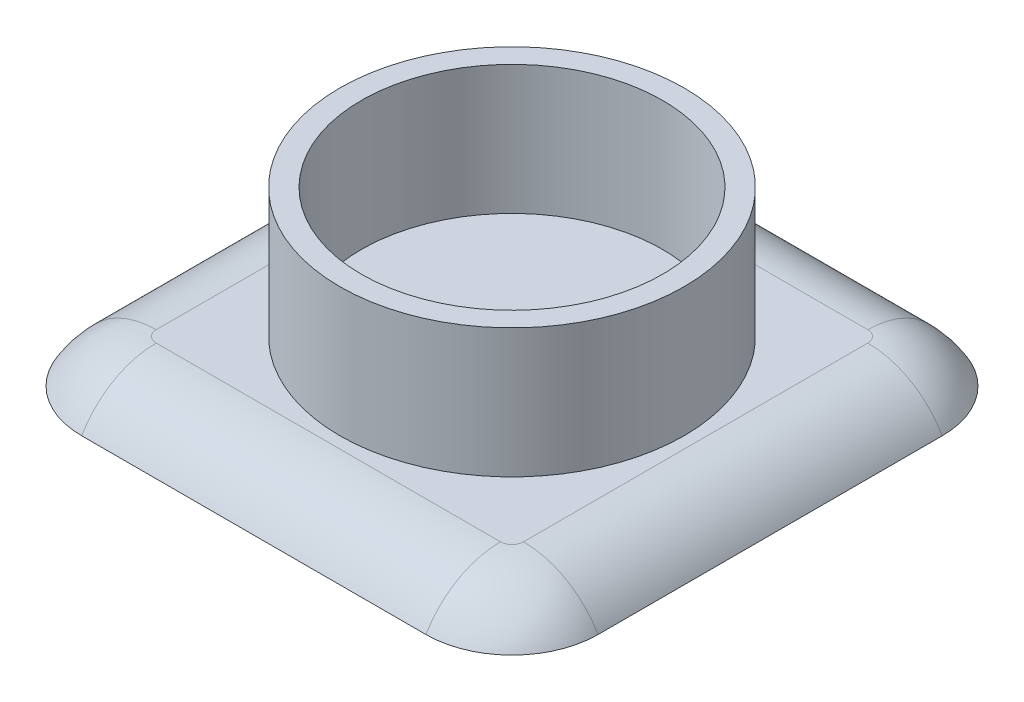
ISO-10303-21;
HEADER;
FILE_DESCRIPTION(('STEP AP214'),'2;1');
FILE_NAME('part.step','',(''),(''),'','','');
FILE_SCHEMA(('AUTOMOTIVE_DESIGN { 1 0 10303 214 1 1 1 1 }'));
ENDSEC;
DATA;
#1=APPLICATION_CONTEXT('core data for automotive mechanical design processes');
#2=APPLICATION_PROTOCOL_DEFINITION('international standard','automotive_design',2000,#1);
#3=PRODUCT_CONTEXT('',#1,'mechanical');
#4=PRODUCT('Part','Part','',(#3));
#5=PRODUCT_RELATED_PRODUCT_CATEGORY('part','',(#4));
#6=PRODUCT_DEFINITION_FORMATION('','',#4);
#7=PRODUCT_DEFINITION_CONTEXT('part definition',#1,'design');
#8=PRODUCT_DEFINITION('design','',#6,#7);
#9=PRODUCT_DEFINITION_SHAPE('','',#8);
#10=(LENGTH_UNIT() NAMED_UNIT(*) SI_UNIT(.MILLI.,.METRE.));
#11=(NAMED_UNIT(*) PLANE_ANGLE_UNIT() SI_UNIT($,.RADIAN.));
#12=(NAMED_UNIT(*) SI_UNIT($,.STERADIAN.) SOLID_ANGLE_UNIT());
#13=UNCERTAINTY_MEASURE_WITH_UNIT(LENGTH_MEASURE(1.E-05),#10,'distance_accuracy_value','');
#14=(GEOMETRIC_REPRESENTATION_CONTEXT(3) GLOBAL_UNCERTAINTY_ASSIGNED_CONTEXT((#13)) GLOBAL_UNIT_ASSIGNED_CONTEXT((#10,
#11,#12)) REPRESENTATION_CONTEXT('',''));
#15=CARTESIAN_POINT('',(0.,0.,0.));
#16=DIRECTION('',(0.,0.,1.));
#17=DIRECTION('',(1.,0.,0.));
#18=AXIS2_PLACEMENT_3D('',#15,#16,#17);
#19=CARTESIAN_POINT('',(0.,3.,0.));
#20=DIRECTION('',(0.,1.,0.));
#21=DIRECTION('',(0.,0.,1.));
#22=AXIS2_PLACEMENT_3D('',#19,#20,#21);
#23=PLANE('',#22);
#24=CARTESIAN_POINT('',(0.,3.,0.));
#25=DIRECTION('',(0.,1.,0.));
#26=DIRECTION('',(0.,0.,1.));
#27=AXIS2_PLACEMENT_3D('',#24,#25,#26);
#28=CIRCLE('',#27,4.);
#29=CARTESIAN_POINT('',(0.,3.,4.00000000000002));
#30=VERTEX_POINT('',#29);
#31=EDGE_CURVE('E163',#30,#30,#28,.T.);
#32=ORIENTED_EDGE('',*,*,#31,.T.);
#33=EDGE_LOOP('',(#32));
#34=FACE_BOUND('',#33,.T.);
#35=CARTESIAN_POINT('',(0.,3.,0.));
#36=DIRECTION('',(0.,1.,0.));
#37=DIRECTION('',(0.,0.,1.));
#38=AXIS2_PLACEMENT_3D('',#35,#36,#37);
#39=CIRCLE('',#38,3.5);
#40=CARTESIAN_POINT('',(0.,3.,3.50000000000001));
#41=VERTEX_POINT('',#40);
#42=EDGE_CURVE('E159',#41,#41,#39,.T.);
#43=ORIENTED_EDGE('',*,*,#42,.F.);
#44=EDGE_LOOP('',(#43));
#45=FACE_BOUND('',#44,.T.);
#46=ADVANCED_FACE('F56',(#34,#45),#23,.T.);
#47=CARTESIAN_POINT('',(0.,3.,0.));
#48=DIRECTION('',(0.,-1.,0.));
#49=DIRECTION('',(0.,0.,-1.));
#50=AXIS2_PLACEMENT_3D('',#47,#48,#49);
#51=CYLINDRICAL_SURFACE('',#50,4.);
#52=ORIENTED_EDGE('',*,*,#31,.F.);
#53=EDGE_LOOP('',(#52));
#54=FACE_BOUND('',#53,.T.);
#55=CARTESIAN_POINT('',(0.,0.,0.));
#56=DIRECTION('',(0.,1.,0.));
#57=DIRECTION('',(0.,0.,1.));
#58=AXIS2_PLACEMENT_3D('',#55,#56,#57);
#59=CIRCLE('',#58,4.);
#60=CARTESIAN_POINT('',(0.,0.,4.00000000000001));
#61=VERTEX_POINT('',#60);
#62=EDGE_CURVE('E158',#61,#61,#59,.T.);
#63=ORIENTED_EDGE('',*,*,#62,.T.);
#64=EDGE_LOOP('',(#63));
#65=FACE_BOUND('',#64,.T.);
#66=ADVANCED_FACE('F254',(#54,#65),#51,.T.);
#67=CARTESIAN_POINT('',(0.,3.,0.));
#68=DIRECTION('',(0.,-1.,0.));
#69=DIRECTION('',(0.,0.,-1.));
#70=AXIS2_PLACEMENT_3D('',#67,#68,#69);
#71=CYLINDRICAL_SURFACE('',#70,3.5);
#72=ORIENTED_EDGE('',*,*,#42,.T.);
#73=EDGE_LOOP('',(#72));
#74=FACE_BOUND('',#73,.T.);
#75=CARTESIAN_POINT('',(0.,0.,0.));
#76=DIRECTION('',(0.,1.,0.));
#77=DIRECTION('',(0.,0.,1.));
#78=AXIS2_PLACEMENT_3D('',#75,#76,#77);
#79=CIRCLE('',#78,3.5);
#80=CARTESIAN_POINT('',(0.,0.,3.50000000000001));
#81=VERTEX_POINT('',#80);
#82=EDGE_CURVE('E164',#81,#81,#79,.T.);
#83=ORIENTED_EDGE('',*,*,#82,.F.);
#84=EDGE_LOOP('',(#83));
#85=FACE_BOUND('',#84,.T.);
#86=ADVANCED_FACE('F260',(#74,#85),#71,.F.);
#87=CARTESIAN_POINT('',(0.,0.,0.));
#88=DIRECTION('',(0.,-1.,0.));
#89=DIRECTION('',(0.,0.,-1.));
#90=AXIS2_PLACEMENT_3D('',#87,#88,#89);
#91=PLANE('',#90);
#92=ORIENTED_EDGE('',*,*,#82,.T.);
#93=EDGE_LOOP('',(#92));
#94=FACE_BOUND('',#93,.T.);
#95=ADVANCED_FACE('F334',(#94),#91,.F.);
#96=CARTESIAN_POINT('',(0.,-0.999999999999999,0.));
#97=DIRECTION('',(0.,-1.,0.));
#98=DIRECTION('',(0.,0.,-1.));
#99=AXIS2_PLACEMENT_3D('',#96,#97,#98);
#100=PLANE('',#99);
#101=DIRECTION('',(0.,0.,1.));
#102=VECTOR('',#101,1.);
#103=CARTESIAN_POINT('',(6.00000000000002,-0.999999999999997,6.));
#104=LINE('',#103,#102);
#105=CARTESIAN_POINT('',(6.,-0.999999999999999,-4.00000000000001));
#106=VERTEX_POINT('',#105);
#107=CARTESIAN_POINT('',(6.,-1.,4.));
#108=VERTEX_POINT('',#107);
#109=EDGE_CURVE('E127',#106,#108,#104,.T.);
#110=ORIENTED_EDGE('',*,*,#109,.T.);
#111=CARTESIAN_POINT('',(4.,-1.,4.));
#112=DIRECTION('',(0.,-1.,0.));
#113=DIRECTION('',(0.,0.,-1.));
#114=AXIS2_PLACEMENT_3D('',#111,#112,#113);
#115=CIRCLE('',#114,2.);
#116=CARTESIAN_POINT('',(4.,-0.99999999999998,6.));
#117=VERTEX_POINT('',#116);
#118=EDGE_CURVE('E119',#108,#117,#115,.T.);
#119=ORIENTED_EDGE('',*,*,#118,.T.);
#120=DIRECTION('',(-1.,0.,0.));
#121=VECTOR('',#120,1.);
#122=CARTESIAN_POINT('',(-6.,-1.,6.));
#123=LINE('',#122,#121);
#124=CARTESIAN_POINT('',(-4.,-1.,6.));
#125=VERTEX_POINT('',#124);
#126=EDGE_CURVE('E124',#117,#125,#123,.T.);
#127=ORIENTED_EDGE('',*,*,#126,.T.);
#128=CARTESIAN_POINT('',(-4.00000000000001,-1.,4.));
#129=DIRECTION('',(0.,-1.,0.));
#130=DIRECTION('',(0.,0.,-1.));
#131=AXIS2_PLACEMENT_3D('',#128,#129,#130);
#132=CIRCLE('',#131,2.);
#133=CARTESIAN_POINT('',(-6.00000000000001,-1.,4.));
#134=VERTEX_POINT('',#133);
#135=EDGE_CURVE('E133',#125,#134,#132,.T.);
#136=ORIENTED_EDGE('',*,*,#135,.T.);
#137=DIRECTION('',(0.,0.,-1.));
#138=VECTOR('',#137,1.);
#139=CARTESIAN_POINT('',(-6.,-1.,6.));
#140=LINE('',#139,#138);
#141=CARTESIAN_POINT('',(-6.00000000000001,-0.999999999999999,-4.00000000000001));
#142=VERTEX_POINT('',#141);
#143=EDGE_CURVE('E147',#134,#142,#140,.T.);
#144=ORIENTED_EDGE('',*,*,#143,.T.);
#145=CARTESIAN_POINT('',(-4.00000000000001,-0.999999999999999,-4.00000000000001));
#146=DIRECTION('',(0.,-1.,0.));
#147=DIRECTION('',(0.,0.,-1.));
#148=AXIS2_PLACEMENT_3D('',#145,#146,#147);
#149=CIRCLE('',#148,2.);
#150=CARTESIAN_POINT('',(-4.00000000000001,-0.999999999999999,-6.00000000000002));
#151=VERTEX_POINT('',#150);
#152=EDGE_CURVE('E177',#142,#151,#149,.T.);
#153=ORIENTED_EDGE('',*,*,#152,.T.);
#154=DIRECTION('',(1.,0.,0.));
#155=VECTOR('',#154,1.);
#156=CARTESIAN_POINT('',(-6.00000000000001,-0.999999999999999,-6.00000000000002));
#157=LINE('',#156,#155);
#158=CARTESIAN_POINT('',(4.,-0.999999999999999,-6.00000000000002));
#159=VERTEX_POINT('',#158);
#160=EDGE_CURVE('E152',#151,#159,#157,.T.);
#161=ORIENTED_EDGE('',*,*,#160,.T.);
#162=CARTESIAN_POINT('',(4.00000000000001,-0.999999999999999,-4.00000000000001));
#163=DIRECTION('',(0.,-1.,0.));
#164=DIRECTION('',(0.,0.,-1.));
#165=AXIS2_PLACEMENT_3D('',#162,#163,#164);
#166=CIRCLE('',#165,2.);
#167=EDGE_CURVE('E171',#159,#106,#166,.T.);
#168=ORIENTED_EDGE('',*,*,#167,.T.);
#169=EDGE_LOOP('',(#110,#119,#127,#136,#144,#153,#161,#168));
#170=FACE_BOUND('',#169,.T.);
#171=ADVANCED_FACE('F121',(#170),#100,.T.);
#172=CARTESIAN_POINT('',(-4.00000000000001,0.,4.));
#173=DIRECTION('',(0.,-1.,0.));
#174=DIRECTION('',(0.,0.,-1.));
#175=AXIS2_PLACEMENT_3D('',#172,#173,#174);
#176=CIRCLE('',#175,0.267949192431123);
#177=CARTESIAN_POINT('',(-4.26794919243113,0.,4.));
#178=VERTEX_POINT('',#177);
#179=CARTESIAN_POINT('',(-4.00000000000001,0.,4.26794919243113));
#180=VERTEX_POINT('',#179);
#181=EDGE_CURVE('E193',#178,#180,#176,.F.);
#182=ORIENTED_EDGE('',*,*,#181,.T.);
#183=DIRECTION('',(-1.,0.,0.));
#184=VECTOR('',#183,1.);
#185=CARTESIAN_POINT('',(0.,0.,4.26794919243112));
#186=LINE('',#185,#184);
#187=CARTESIAN_POINT('',(4.,0.,4.26794919243112));
#188=VERTEX_POINT('',#187);
#189=EDGE_CURVE('E13',#180,#188,#186,.F.);
#190=ORIENTED_EDGE('',*,*,#189,.T.);
#191=CARTESIAN_POINT('',(4.,0.,4.));
#192=DIRECTION('',(0.,-1.,0.));
#193=DIRECTION('',(0.,0.,-1.));
#194=AXIS2_PLACEMENT_3D('',#191,#192,#193);
#195=CIRCLE('',#194,0.267949192431123);
#196=CARTESIAN_POINT('',(4.26794919243112,0.,4.));
#197=VERTEX_POINT('',#196);
#198=EDGE_CURVE('E66',#188,#197,#195,.F.);
#199=ORIENTED_EDGE('',*,*,#198,.T.);
#200=DIRECTION('',(0.,0.,1.));
#201=VECTOR('',#200,1.);
#202=CARTESIAN_POINT('',(4.26794919243112,0.,0.));
#203=LINE('',#202,#201);
#204=CARTESIAN_POINT('',(4.26794919243114,0.,-4.));
#205=VERTEX_POINT('',#204);
#206=EDGE_CURVE('E196',#197,#205,#203,.F.);
#207=ORIENTED_EDGE('',*,*,#206,.T.);
#208=CARTESIAN_POINT('',(4.00000000000002,0.,-4.));
#209=DIRECTION('',(0.,-1.,0.));
#210=DIRECTION('',(0.,0.,-1.));
#211=AXIS2_PLACEMENT_3D('',#208,#209,#210);
#212=CIRCLE('',#211,0.267949192431123);
#213=CARTESIAN_POINT('',(4.,0.,-4.26794919243112));
#214=VERTEX_POINT('',#213);
#215=EDGE_CURVE('E190',#205,#214,#212,.F.);
#216=ORIENTED_EDGE('',*,*,#215,.T.);
#217=DIRECTION('',(1.,0.,0.));
#218=VECTOR('',#217,1.);
#219=CARTESIAN_POINT('',(0.,0.,-4.26794919243114));
#220=LINE('',#219,#218);
#221=CARTESIAN_POINT('',(-4.00000000000001,0.,-4.26794919243113));
#222=VERTEX_POINT('',#221);
#223=EDGE_CURVE('E187',#214,#222,#220,.F.);
#224=ORIENTED_EDGE('',*,*,#223,.T.);
#225=CARTESIAN_POINT('',(-4.00000000000001,0.,-4.00000000000001));
#226=DIRECTION('',(0.,-1.,0.));
#227=DIRECTION('',(0.,0.,-1.));
#228=AXIS2_PLACEMENT_3D('',#225,#226,#227);
#229=CIRCLE('',#228,0.267949192431123);
#230=CARTESIAN_POINT('',(-4.26794919243113,0.,-4.00000000000001));
#231=VERTEX_POINT('',#230);
#232=EDGE_CURVE('E184',#222,#231,#229,.F.);
#233=ORIENTED_EDGE('',*,*,#232,.T.);
#234=DIRECTION('',(0.,0.,-1.));
#235=VECTOR('',#234,1.);
#236=CARTESIAN_POINT('',(-4.26794919243113,0.,0.));
#237=LINE('',#236,#235);
#238=EDGE_CURVE('E132',#231,#178,#237,.F.);
#239=ORIENTED_EDGE('',*,*,#238,.T.);
#240=EDGE_LOOP('',(#182,#190,#199,#207,#216,#224,#233,#239));
#241=FACE_BOUND('',#240,.T.);
#242=ORIENTED_EDGE('',*,*,#62,.F.);
#243=EDGE_LOOP('',(#242));
#244=FACE_BOUND('',#243,.T.);
#245=ADVANCED_FACE('F243',(#241,#244),#91,.F.);
#246=CARTESIAN_POINT('',(4.00000000000001,-2.,-4.00000000000001));
#247=DIRECTION('',(0.,1.,0.));
#248=DIRECTION('',(0.,0.,1.));
#249=AXIS2_PLACEMENT_3D('',#246,#247,#248);
#250=DEGENERATE_TOROIDAL_SURFACE('',#249,0.267949192431123,2.,.T.);
#251=CARTESIAN_POINT('',(4.26794919243103,-2.,-4.));
#252=DIRECTION('',(0.,0.,1.));
#253=DIRECTION('',(1.,0.,0.));
#254=AXIS2_PLACEMENT_3D('',#251,#252,#253);
#255=CIRCLE('',#254,2.);
#256=EDGE_CURVE('E214',#106,#205,#255,.T.);
#257=ORIENTED_EDGE('',*,*,#256,.F.);
#258=ORIENTED_EDGE('',*,*,#167,.F.);
#259=CARTESIAN_POINT('',(4.,-2.,-4.26794919243113));
#260=DIRECTION('',(-1.,0.,0.));
#261=DIRECTION('',(0.,0.,1.));
#262=AXIS2_PLACEMENT_3D('',#259,#260,#261);
#263=CIRCLE('',#262,2.);
#264=EDGE_CURVE('E60',#214,#159,#263,.T.);
#265=ORIENTED_EDGE('',*,*,#264,.F.);
#266=ORIENTED_EDGE('',*,*,#215,.F.);
#267=EDGE_LOOP('',(#257,#258,#265,#266));
#268=FACE_BOUND('',#267,.T.);
#269=ADVANCED_FACE('F58',(#268),#250,.T.);
#270=CARTESIAN_POINT('',(-6.00000000000001,-2.,-4.26794919243114));
#271=DIRECTION('',(1.,0.,0.));
#272=DIRECTION('',(0.,0.,-1.));
#273=AXIS2_PLACEMENT_3D('',#270,#271,#272);
#274=CYLINDRICAL_SURFACE('',#273,2.);
#275=ORIENTED_EDGE('',*,*,#264,.T.);
#276=ORIENTED_EDGE('',*,*,#160,.F.);
#277=CARTESIAN_POINT('',(-4.00000000000001,-2.,-4.26794919243114));
#278=DIRECTION('',(-1.,0.,0.));
#279=DIRECTION('',(0.,0.,1.));
#280=AXIS2_PLACEMENT_3D('',#277,#278,#279);
#281=CIRCLE('',#280,2.);
#282=EDGE_CURVE('E211',#222,#151,#281,.T.);
#283=ORIENTED_EDGE('',*,*,#282,.F.);
#284=ORIENTED_EDGE('',*,*,#223,.F.);
#285=EDGE_LOOP('',(#275,#276,#283,#284));
#286=FACE_BOUND('',#285,.T.);
#287=ADVANCED_FACE('F227',(#286),#274,.T.);
#288=CARTESIAN_POINT('',(4.26794919243113,-2.,6.00000000000002));
#289=DIRECTION('',(0.,0.,1.));
#290=DIRECTION('',(1.,0.,0.));
#291=AXIS2_PLACEMENT_3D('',#288,#289,#290);
#292=CYLINDRICAL_SURFACE('',#291,2.);
#293=ORIENTED_EDGE('',*,*,#256,.T.);
#294=ORIENTED_EDGE('',*,*,#206,.F.);
#295=CARTESIAN_POINT('',(4.26794919243103,-2.,4.));
#296=DIRECTION('',(0.,0.,1.));
#297=DIRECTION('',(1.,0.,0.));
#298=AXIS2_PLACEMENT_3D('',#295,#296,#297);
#299=CIRCLE('',#298,2.);
#300=EDGE_CURVE('E208',#108,#197,#299,.T.);
#301=ORIENTED_EDGE('',*,*,#300,.F.);
#302=ORIENTED_EDGE('',*,*,#109,.F.);
#303=EDGE_LOOP('',(#293,#294,#301,#302));
#304=FACE_BOUND('',#303,.T.);
#305=ADVANCED_FACE('F245',(#304),#292,.T.);
#306=CARTESIAN_POINT('',(-4.00000000000001,-2.,-4.00000000000001));
#307=DIRECTION('',(0.,1.,0.));
#308=DIRECTION('',(0.,0.,1.));
#309=AXIS2_PLACEMENT_3D('',#306,#307,#308);
#310=DEGENERATE_TOROIDAL_SURFACE('',#309,0.267949192431123,2.,.T.);
#311=ORIENTED_EDGE('',*,*,#282,.T.);
#312=ORIENTED_EDGE('',*,*,#152,.F.);
#313=CARTESIAN_POINT('',(-4.26794919243113,-2.,-4.00000000000001));
#314=DIRECTION('',(0.,0.,1.));
#315=DIRECTION('',(1.,0.,0.));
#316=AXIS2_PLACEMENT_3D('',#313,#314,#315);
#317=CIRCLE('',#316,2.);
#318=EDGE_CURVE('E140',#231,#142,#317,.T.);
#319=ORIENTED_EDGE('',*,*,#318,.F.);
#320=ORIENTED_EDGE('',*,*,#232,.F.);
#321=EDGE_LOOP('',(#311,#312,#319,#320));
#322=FACE_BOUND('',#321,.T.);
#323=ADVANCED_FACE('F236',(#322),#310,.T.);
#324=CARTESIAN_POINT('',(4.,-2.,4.));
#325=DIRECTION('',(0.,1.,0.));
#326=DIRECTION('',(0.,0.,1.));
#327=AXIS2_PLACEMENT_3D('',#324,#325,#326);
#328=DEGENERATE_TOROIDAL_SURFACE('',#327,0.267949192431123,2.,.T.);
#329=ORIENTED_EDGE('',*,*,#300,.T.);
#330=ORIENTED_EDGE('',*,*,#198,.F.);
#331=CARTESIAN_POINT('',(4.,-2.,4.26794919243104));
#332=DIRECTION('',(-1.,0.,0.));
#333=DIRECTION('',(0.,0.,1.));
#334=AXIS2_PLACEMENT_3D('',#331,#332,#333);
#335=CIRCLE('',#334,2.);
#336=EDGE_CURVE('E136',#117,#188,#335,.T.);
#337=ORIENTED_EDGE('',*,*,#336,.F.);
#338=ORIENTED_EDGE('',*,*,#118,.F.);
#339=EDGE_LOOP('',(#329,#330,#337,#338));
#340=FACE_BOUND('',#339,.T.);
#341=ADVANCED_FACE('F137',(#340),#328,.T.);
#342=CARTESIAN_POINT('',(-4.26794919243113,-2.,6.00000000000001));
#343=DIRECTION('',(0.,0.,-1.));
#344=DIRECTION('',(-1.,0.,0.));
#345=AXIS2_PLACEMENT_3D('',#342,#343,#344);
#346=CYLINDRICAL_SURFACE('',#345,2.);
#347=ORIENTED_EDGE('',*,*,#318,.T.);
#348=ORIENTED_EDGE('',*,*,#143,.F.);
#349=CARTESIAN_POINT('',(-4.26794919243113,-2.,4.00000000000001));
#350=DIRECTION('',(0.,0.,1.));
#351=DIRECTION('',(1.,0.,0.));
#352=AXIS2_PLACEMENT_3D('',#349,#350,#351);
#353=CIRCLE('',#352,2.);
#354=EDGE_CURVE('E141',#178,#134,#353,.T.);
#355=ORIENTED_EDGE('',*,*,#354,.F.);
#356=ORIENTED_EDGE('',*,*,#238,.F.);
#357=EDGE_LOOP('',(#347,#348,#355,#356));
#358=FACE_BOUND('',#357,.T.);
#359=ADVANCED_FACE('F240',(#358),#346,.T.);
#360=CARTESIAN_POINT('',(-6.00000000000001,-2.,4.26794919243113));
#361=DIRECTION('',(-1.,0.,0.));
#362=DIRECTION('',(0.,0.,1.));
#363=AXIS2_PLACEMENT_3D('',#360,#361,#362);
#364=CYLINDRICAL_SURFACE('',#363,2.);
#365=ORIENTED_EDGE('',*,*,#336,.T.);
#366=ORIENTED_EDGE('',*,*,#189,.F.);
#367=CARTESIAN_POINT('',(-4.00000000000001,-2.,4.26794919243104));
#368=DIRECTION('',(-1.,0.,0.));
#369=DIRECTION('',(0.,0.,1.));
#370=AXIS2_PLACEMENT_3D('',#367,#368,#369);
#371=CIRCLE('',#370,2.);
#372=EDGE_CURVE('E145',#125,#180,#371,.T.);
#373=ORIENTED_EDGE('',*,*,#372,.F.);
#374=ORIENTED_EDGE('',*,*,#126,.F.);
#375=EDGE_LOOP('',(#365,#366,#373,#374));
#376=FACE_BOUND('',#375,.T.);
#377=ADVANCED_FACE('F144',(#376),#364,.T.);
#378=CARTESIAN_POINT('',(-4.00000000000001,-2.,4.00000000000001));
#379=DIRECTION('',(0.,1.,0.));
#380=DIRECTION('',(0.,0.,1.));
#381=AXIS2_PLACEMENT_3D('',#378,#379,#380);
#382=DEGENERATE_TOROIDAL_SURFACE('',#381,0.267949192431123,2.,.T.);
#383=ORIENTED_EDGE('',*,*,#354,.T.);
#384=ORIENTED_EDGE('',*,*,#135,.F.);
#385=ORIENTED_EDGE('',*,*,#372,.T.);
#386=ORIENTED_EDGE('',*,*,#181,.F.);
#387=EDGE_LOOP('',(#383,#384,#385,#386));
#388=FACE_BOUND('',#387,.T.);
#389=ADVANCED_FACE('F267',(#388),#382,.T.);
#390=CLOSED_SHELL('',(#46,#66,#86,#95,#171,#245,#269,#287,#305,#323,#341,#359,#377,#389));
#391=MANIFOLD_SOLID_BREP('B2',#390);
#392=ADVANCED_BREP_SHAPE_REPRESENTATION('',(#18,#391),#14);
#393=SHAPE_DEFINITION_REPRESENTATION(#9,#392);
ENDSEC;
END-ISO-10303-21;
